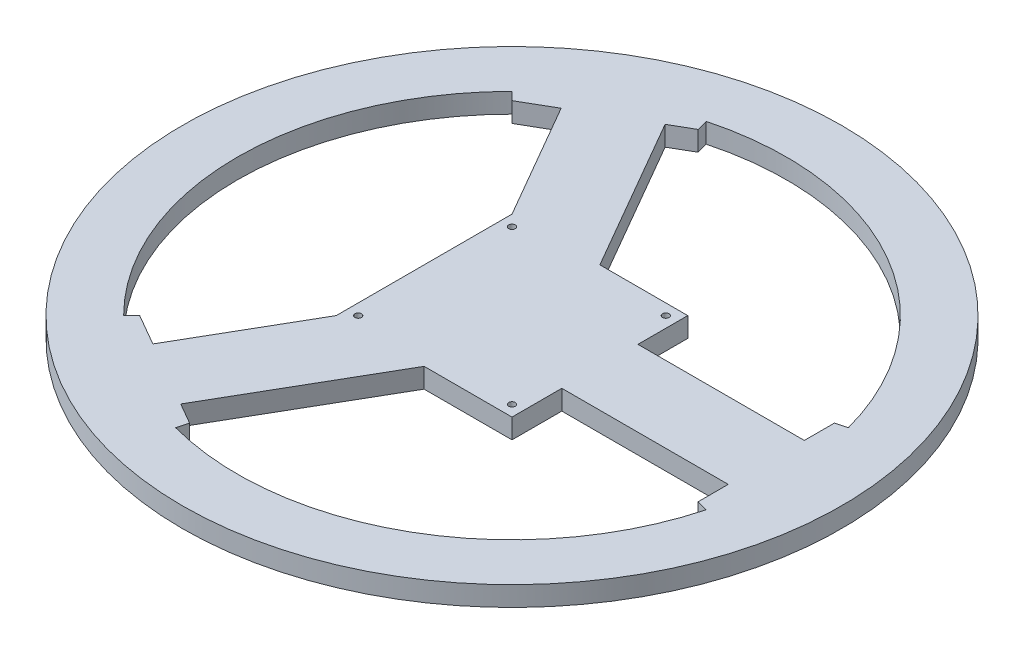
ISO-10303-21;
HEADER;
FILE_DESCRIPTION(('STEP AP214'),'2;1');
FILE_NAME('part.step','',(''),(''),'','','');
FILE_SCHEMA(('AUTOMOTIVE_DESIGN { 1 0 10303 214 1 1 1 1 }'));
ENDSEC;
DATA;
#1=APPLICATION_CONTEXT('core data for automotive mechanical design processes');
#2=APPLICATION_PROTOCOL_DEFINITION('international standard','automotive_design',2000,#1);
#3=PRODUCT_CONTEXT('',#1,'mechanical');
#4=PRODUCT('Part','Part','',(#3));
#5=PRODUCT_RELATED_PRODUCT_CATEGORY('part','',(#4));
#6=PRODUCT_DEFINITION_FORMATION('','',#4);
#7=PRODUCT_DEFINITION_CONTEXT('part definition',#1,'design');
#8=PRODUCT_DEFINITION('design','',#6,#7);
#9=PRODUCT_DEFINITION_SHAPE('','',#8);
#10=(LENGTH_UNIT() NAMED_UNIT(*) SI_UNIT(.MILLI.,.METRE.));
#11=(NAMED_UNIT(*) PLANE_ANGLE_UNIT() SI_UNIT($,.RADIAN.));
#12=(NAMED_UNIT(*) SI_UNIT($,.STERADIAN.) SOLID_ANGLE_UNIT());
#13=UNCERTAINTY_MEASURE_WITH_UNIT(LENGTH_MEASURE(1.E-05),#10,'distance_accuracy_value','');
#14=(GEOMETRIC_REPRESENTATION_CONTEXT(3) GLOBAL_UNCERTAINTY_ASSIGNED_CONTEXT((#13)) GLOBAL_UNIT_ASSIGNED_CONTEXT((#10,
#11,#12)) REPRESENTATION_CONTEXT('',''));
#15=CARTESIAN_POINT('',(0.,0.,0.));
#16=DIRECTION('',(0.,0.,1.));
#17=DIRECTION('',(1.,0.,0.));
#18=AXIS2_PLACEMENT_3D('',#15,#16,#17);
#19=CARTESIAN_POINT('',(115.740728286134,9.,-31.0126346756591));
#20=DIRECTION('',(1.,0.,0.));
#21=DIRECTION('',(0.,0.,-1.));
#22=AXIS2_PLACEMENT_3D('',#19,#20,#21);
#23=PLANE('',#22);
#24=DIRECTION('',(0.,-1.,0.));
#25=VECTOR('',#24,1.);
#26=CARTESIAN_POINT('',(115.740728286134,9.,17.32));
#27=LINE('',#26,#25);
#28=CARTESIAN_POINT('',(115.740728286134,9.,17.32));
#29=VERTEX_POINT('',#28);
#30=CARTESIAN_POINT('',(115.740728286134,0.,17.32));
#31=VERTEX_POINT('',#30);
#32=EDGE_CURVE('E239',#29,#31,#27,.T.);
#33=ORIENTED_EDGE('',*,*,#32,.T.);
#34=DIRECTION('',(0.,0.,1.));
#35=VECTOR('',#34,1.);
#36=CARTESIAN_POINT('',(115.740728286134,0.,-31.0126346756591));
#37=LINE('',#36,#35);
#38=CARTESIAN_POINT('',(115.740728286134,0.,31.0126346756592));
#39=VERTEX_POINT('',#38);
#40=EDGE_CURVE('E309',#31,#39,#37,.T.);
#41=ORIENTED_EDGE('',*,*,#40,.T.);
#42=DIRECTION('',(0.,-1.,0.));
#43=VECTOR('',#42,1.);
#44=CARTESIAN_POINT('',(115.740728286134,9.,31.0126346756592));
#45=LINE('',#44,#43);
#46=CARTESIAN_POINT('',(115.740728286134,9.,31.0126346756592));
#47=VERTEX_POINT('',#46);
#48=EDGE_CURVE('E304',#47,#39,#45,.T.);
#49=ORIENTED_EDGE('',*,*,#48,.F.);
#50=DIRECTION('',(0.,0.,1.));
#51=VECTOR('',#50,1.);
#52=CARTESIAN_POINT('',(115.740728286134,9.,-31.0126346756591));
#53=LINE('',#52,#51);
#54=EDGE_CURVE('E49',#29,#47,#53,.T.);
#55=ORIENTED_EDGE('',*,*,#54,.F.);
#56=EDGE_LOOP('',(#33,#41,#49,#55));
#57=FACE_BOUND('',#56,.T.);
#58=ADVANCED_FACE('F34',(#57),#23,.F.);
#59=DIRECTION('',(0.,-1.,0.));
#60=VECTOR('',#59,1.);
#61=CARTESIAN_POINT('',(115.740728286134,9.,-17.32));
#62=LINE('',#61,#60);
#63=CARTESIAN_POINT('',(115.740728286134,9.,-17.32));
#64=VERTEX_POINT('',#63);
#65=CARTESIAN_POINT('',(115.740728286134,0.,-17.32));
#66=VERTEX_POINT('',#65);
#67=EDGE_CURVE('E57',#64,#66,#62,.T.);
#68=ORIENTED_EDGE('',*,*,#67,.F.);
#69=CARTESIAN_POINT('',(115.740728286134,9.,-31.0126346756591));
#70=VERTEX_POINT('',#69);
#71=EDGE_CURVE('E302',#70,#64,#53,.T.);
#72=ORIENTED_EDGE('',*,*,#71,.F.);
#73=DIRECTION('',(0.,-1.,0.));
#74=VECTOR('',#73,1.);
#75=CARTESIAN_POINT('',(115.740728286134,9.,-31.0126346756591));
#76=LINE('',#75,#74);
#77=CARTESIAN_POINT('',(115.740728286134,0.,-31.0126346756591));
#78=VERTEX_POINT('',#77);
#79=EDGE_CURVE('E313',#70,#78,#76,.T.);
#80=ORIENTED_EDGE('',*,*,#79,.T.);
#81=EDGE_CURVE('E300',#78,#66,#37,.T.);
#82=ORIENTED_EDGE('',*,*,#81,.T.);
#83=EDGE_LOOP('',(#68,#72,#80,#82));
#84=FACE_BOUND('',#83,.T.);
#85=ADVANCED_FACE('F456',(#84),#23,.F.);
#86=CARTESIAN_POINT('',(-31.0126346756598,9.,115.740728286134));
#87=DIRECTION('',(-0.5,0.,0.866025403784439));
#88=DIRECTION('',(0.866025403784439,0.,0.5));
#89=AXIS2_PLACEMENT_3D('',#86,#87,#88);
#90=PLANE('',#89);
#91=DIRECTION('',(0.,-1.,0.));
#92=VECTOR('',#91,1.);
#93=CARTESIAN_POINT('',(-70.5498560673779,9.,92.9139028726152));
#94=LINE('',#93,#92);
#95=CARTESIAN_POINT('',(-70.5498560673779,9.,92.9139028726153));
#96=VERTEX_POINT('',#95);
#97=CARTESIAN_POINT('',(-70.5498560673779,0.,92.9139028726153));
#98=VERTEX_POINT('',#97);
#99=EDGE_CURVE('E383',#96,#98,#94,.T.);
#100=ORIENTED_EDGE('',*,*,#99,.T.);
#101=DIRECTION('',(-0.866025403784439,0.,-0.5));
#102=VECTOR('',#101,1.);
#103=CARTESIAN_POINT('',(-31.0126346756598,0.,115.740728286134));
#104=LINE('',#103,#102);
#105=CARTESIAN_POINT('',(-84.7280936104738,0.,84.7280936104744));
#106=VERTEX_POINT('',#105);
#107=EDGE_CURVE('E282',#98,#106,#104,.T.);
#108=ORIENTED_EDGE('',*,*,#107,.T.);
#109=DIRECTION('',(0.,-1.,0.));
#110=VECTOR('',#109,1.);
#111=CARTESIAN_POINT('',(-84.7280936104738,9.,84.7280936104744));
#112=LINE('',#111,#110);
#113=CARTESIAN_POINT('',(-84.7280936104738,9.,84.7280936104744));
#114=VERTEX_POINT('',#113);
#115=EDGE_CURVE('E277',#114,#106,#112,.T.);
#116=ORIENTED_EDGE('',*,*,#115,.F.);
#117=DIRECTION('',(-0.866025403784439,0.,-0.5));
#118=VECTOR('',#117,1.);
#119=CARTESIAN_POINT('',(-31.0126346756598,9.,115.740728286134));
#120=LINE('',#119,#118);
#121=EDGE_CURVE('E274',#96,#114,#120,.T.);
#122=ORIENTED_EDGE('',*,*,#121,.F.);
#123=EDGE_LOOP('',(#100,#108,#116,#122));
#124=FACE_BOUND('',#123,.T.);
#125=ADVANCED_FACE('F482',(#124),#90,.F.);
#126=DIRECTION('',(0.,-1.,0.));
#127=VECTOR('',#126,1.);
#128=CARTESIAN_POINT('',(-40.5498560673779,9.,110.234410948304));
#129=LINE('',#128,#127);
#130=CARTESIAN_POINT('',(-40.5498560673779,9.,110.234410948304));
#131=VERTEX_POINT('',#130);
#132=CARTESIAN_POINT('',(-40.5498560673779,0.,110.234410948304));
#133=VERTEX_POINT('',#132);
#134=EDGE_CURVE('E380',#131,#133,#129,.T.);
#135=ORIENTED_EDGE('',*,*,#134,.F.);
#136=CARTESIAN_POINT('',(-31.0126346756598,9.,115.740728286134));
#137=VERTEX_POINT('',#136);
#138=EDGE_CURVE('E275',#137,#131,#120,.T.);
#139=ORIENTED_EDGE('',*,*,#138,.F.);
#140=DIRECTION('',(0.,-1.,0.));
#141=VECTOR('',#140,1.);
#142=CARTESIAN_POINT('',(-31.0126346756598,9.,115.740728286134));
#143=LINE('',#142,#141);
#144=CARTESIAN_POINT('',(-31.0126346756598,0.,115.740728286134));
#145=VERTEX_POINT('',#144);
#146=EDGE_CURVE('E286',#137,#145,#143,.T.);
#147=ORIENTED_EDGE('',*,*,#146,.T.);
#148=EDGE_CURVE('E272',#145,#133,#104,.T.);
#149=ORIENTED_EDGE('',*,*,#148,.T.);
#150=EDGE_LOOP('',(#135,#139,#147,#149));
#151=FACE_BOUND('',#150,.T.);
#152=ADVANCED_FACE('F475',(#151),#90,.F.);
#153=CARTESIAN_POINT('',(-84.7280936104739,9.,-84.7280936104743));
#154=DIRECTION('',(-0.500000000000001,0.,-0.866025403784438));
#155=DIRECTION('',(-0.866025403784438,0.,0.500000000000001));
#156=AXIS2_PLACEMENT_3D('',#153,#154,#155);
#157=PLANE('',#156);
#158=DIRECTION('',(0.,-1.,0.));
#159=VECTOR('',#158,1.);
#160=CARTESIAN_POINT('',(-40.5498560673779,9.,-110.234410948304));
#161=LINE('',#160,#159);
#162=CARTESIAN_POINT('',(-40.5498560673779,9.,-110.234410948304));
#163=VERTEX_POINT('',#162);
#164=CARTESIAN_POINT('',(-40.5498560673779,0.,-110.234410948304));
#165=VERTEX_POINT('',#164);
#166=EDGE_CURVE('E394',#163,#165,#161,.T.);
#167=ORIENTED_EDGE('',*,*,#166,.T.);
#168=DIRECTION('',(0.866025403784438,0.,-0.500000000000001));
#169=VECTOR('',#168,1.);
#170=CARTESIAN_POINT('',(-84.7280936104739,0.,-84.7280936104743));
#171=LINE('',#170,#169);
#172=CARTESIAN_POINT('',(-31.0126346756599,0.,-115.740728286133));
#173=VERTEX_POINT('',#172);
#174=EDGE_CURVE('E254',#165,#173,#171,.T.);
#175=ORIENTED_EDGE('',*,*,#174,.T.);
#176=DIRECTION('',(0.,-1.,0.));
#177=VECTOR('',#176,1.);
#178=CARTESIAN_POINT('',(-31.0126346756599,9.,-115.740728286133));
#179=LINE('',#178,#177);
#180=CARTESIAN_POINT('',(-31.0126346756599,9.,-115.740728286133));
#181=VERTEX_POINT('',#180);
#182=EDGE_CURVE('E251',#181,#173,#179,.T.);
#183=ORIENTED_EDGE('',*,*,#182,.F.);
#184=DIRECTION('',(0.866025403784438,0.,-0.500000000000001));
#185=VECTOR('',#184,1.);
#186=CARTESIAN_POINT('',(-84.7280936104739,9.,-84.7280936104743));
#187=LINE('',#186,#185);
#188=EDGE_CURVE('E248',#163,#181,#187,.T.);
#189=ORIENTED_EDGE('',*,*,#188,.F.);
#190=EDGE_LOOP('',(#167,#175,#183,#189));
#191=FACE_BOUND('',#190,.T.);
#192=ADVANCED_FACE('F472',(#191),#157,.F.);
#193=DIRECTION('',(0.,-1.,0.));
#194=VECTOR('',#193,1.);
#195=CARTESIAN_POINT('',(-70.5498560673779,9.,-92.9139028726152));
#196=LINE('',#195,#194);
#197=CARTESIAN_POINT('',(-70.5498560673779,9.,-92.9139028726152));
#198=VERTEX_POINT('',#197);
#199=CARTESIAN_POINT('',(-70.5498560673779,0.,-92.9139028726152));
#200=VERTEX_POINT('',#199);
#201=EDGE_CURVE('E391',#198,#200,#196,.T.);
#202=ORIENTED_EDGE('',*,*,#201,.F.);
#203=CARTESIAN_POINT('',(-84.7280936104739,9.,-84.7280936104743));
#204=VERTEX_POINT('',#203);
#205=EDGE_CURVE('E249',#204,#198,#187,.T.);
#206=ORIENTED_EDGE('',*,*,#205,.F.);
#207=DIRECTION('',(0.,-1.,0.));
#208=VECTOR('',#207,1.);
#209=CARTESIAN_POINT('',(-84.7280936104739,9.,-84.7280936104743));
#210=LINE('',#209,#208);
#211=CARTESIAN_POINT('',(-84.7280936104739,0.,-84.7280936104743));
#212=VERTEX_POINT('',#211);
#213=EDGE_CURVE('E258',#204,#212,#210,.T.);
#214=ORIENTED_EDGE('',*,*,#213,.T.);
#215=EDGE_CURVE('E246',#212,#200,#171,.T.);
#216=ORIENTED_EDGE('',*,*,#215,.T.);
#217=EDGE_LOOP('',(#202,#206,#214,#216));
#218=FACE_BOUND('',#217,.T.);
#219=ADVANCED_FACE('F474',(#218),#157,.F.);
#220=CARTESIAN_POINT('',(0.,9.,0.));
#221=DIRECTION('',(0.,-1.,0.));
#222=DIRECTION('',(0.,0.,-1.));
#223=AXIS2_PLACEMENT_3D('',#220,#221,#222);
#224=CYLINDRICAL_SURFACE('',#223,125.);
#225=CARTESIAN_POINT('',(0.,9.,0.));
#226=DIRECTION('',(0.,1.,0.));
#227=DIRECTION('',(0.,0.,1.));
#228=AXIS2_PLACEMENT_3D('',#225,#226,#227);
#229=CIRCLE('',#228,125.);
#230=CARTESIAN_POINT('',(120.740728286134,9.,-32.3523806378147));
#231=VERTEX_POINT('',#230);
#232=CARTESIAN_POINT('',(-32.3523806378155,9.,-120.740728286133));
#233=VERTEX_POINT('',#232);
#234=EDGE_CURVE('E323',#231,#233,#229,.T.);
#235=ORIENTED_EDGE('',*,*,#234,.T.);
#236=DIRECTION('',(0.,-1.,0.));
#237=VECTOR('',#236,1.);
#238=CARTESIAN_POINT('',(-32.3523806378155,9.,-120.740728286133));
#239=LINE('',#238,#237);
#240=CARTESIAN_POINT('',(-32.3523806378155,0.,-120.740728286133));
#241=VERTEX_POINT('',#240);
#242=EDGE_CURVE('E264',#233,#241,#239,.T.);
#243=ORIENTED_EDGE('',*,*,#242,.T.);
#244=CARTESIAN_POINT('',(0.,0.,0.));
#245=DIRECTION('',(0.,1.,0.));
#246=DIRECTION('',(0.,0.,1.));
#247=AXIS2_PLACEMENT_3D('',#244,#245,#246);
#248=CIRCLE('',#247,125.);
#249=CARTESIAN_POINT('',(120.740728286134,0.,-32.3523806378148));
#250=VERTEX_POINT('',#249);
#251=EDGE_CURVE('E328',#250,#241,#248,.T.);
#252=ORIENTED_EDGE('',*,*,#251,.F.);
#253=DIRECTION('',(0.,-1.,0.));
#254=VECTOR('',#253,1.);
#255=CARTESIAN_POINT('',(120.740728286134,9.,-32.3523806378147));
#256=LINE('',#255,#254);
#257=EDGE_CURVE('E316',#231,#250,#256,.T.);
#258=ORIENTED_EDGE('',*,*,#257,.F.);
#259=EDGE_LOOP('',(#235,#243,#252,#258));
#260=FACE_BOUND('',#259,.T.);
#261=ADVANCED_FACE('F461',(#260),#224,.F.);
#262=CARTESIAN_POINT('',(-88.3883476483182,0.,-88.3883476483187));
#263=VERTEX_POINT('',#262);
#264=CARTESIAN_POINT('',(-88.3883476483182,0.,88.3883476483188));
#265=VERTEX_POINT('',#264);
#266=EDGE_CURVE('E330',#263,#265,#248,.T.);
#267=ORIENTED_EDGE('',*,*,#266,.F.);
#268=DIRECTION('',(0.,-1.,0.));
#269=VECTOR('',#268,1.);
#270=CARTESIAN_POINT('',(-88.3883476483183,9.,-88.3883476483187));
#271=LINE('',#270,#269);
#272=CARTESIAN_POINT('',(-88.3883476483183,9.,-88.3883476483187));
#273=VERTEX_POINT('',#272);
#274=EDGE_CURVE('E261',#273,#263,#271,.T.);
#275=ORIENTED_EDGE('',*,*,#274,.F.);
#276=CARTESIAN_POINT('',(-88.3883476483182,9.,88.3883476483188));
#277=VERTEX_POINT('',#276);
#278=EDGE_CURVE('E326',#273,#277,#229,.T.);
#279=ORIENTED_EDGE('',*,*,#278,.T.);
#280=DIRECTION('',(0.,-1.,0.));
#281=VECTOR('',#280,1.);
#282=CARTESIAN_POINT('',(-88.3883476483182,9.,88.3883476483188));
#283=LINE('',#282,#281);
#284=EDGE_CURVE('E292',#277,#265,#283,.T.);
#285=ORIENTED_EDGE('',*,*,#284,.T.);
#286=EDGE_LOOP('',(#267,#275,#279,#285));
#287=FACE_BOUND('',#286,.T.);
#288=ADVANCED_FACE('F502',(#287),#224,.F.);
#289=CARTESIAN_POINT('',(-32.3523806378154,0.,120.740728286133));
#290=VERTEX_POINT('',#289);
#291=CARTESIAN_POINT('',(120.740728286134,0.,32.3523806378148));
#292=VERTEX_POINT('',#291);
#293=EDGE_CURVE('E322',#290,#292,#248,.T.);
#294=ORIENTED_EDGE('',*,*,#293,.F.);
#295=DIRECTION('',(0.,-1.,0.));
#296=VECTOR('',#295,1.);
#297=CARTESIAN_POINT('',(-32.3523806378154,9.,120.740728286134));
#298=LINE('',#297,#296);
#299=CARTESIAN_POINT('',(-32.3523806378154,9.,120.740728286134));
#300=VERTEX_POINT('',#299);
#301=EDGE_CURVE('E289',#300,#290,#298,.T.);
#302=ORIENTED_EDGE('',*,*,#301,.F.);
#303=CARTESIAN_POINT('',(120.740728286134,9.,32.3523806378148));
#304=VERTEX_POINT('',#303);
#305=EDGE_CURVE('E327',#300,#304,#229,.T.);
#306=ORIENTED_EDGE('',*,*,#305,.T.);
#307=DIRECTION('',(0.,-1.,0.));
#308=VECTOR('',#307,1.);
#309=CARTESIAN_POINT('',(120.740728286134,9.,32.3523806378148));
#310=LINE('',#309,#308);
#311=EDGE_CURVE('E319',#304,#292,#310,.T.);
#312=ORIENTED_EDGE('',*,*,#311,.T.);
#313=EDGE_LOOP('',(#294,#302,#306,#312));
#314=FACE_BOUND('',#313,.T.);
#315=ADVANCED_FACE('F348',(#314),#224,.F.);
#316=CARTESIAN_POINT('',(0.,9.,0.));
#317=DIRECTION('',(0.,1.,0.));
#318=DIRECTION('',(0.,0.,1.));
#319=AXIS2_PLACEMENT_3D('',#316,#317,#318);
#320=PLANE('',#319);
#321=ORIENTED_EDGE('',*,*,#71,.T.);
#322=DIRECTION('',(-1.,0.,0.));
#323=VECTOR('',#322,1.);
#324=CARTESIAN_POINT('',(40.,9.,-17.32));
#325=LINE('',#324,#323);
#326=CARTESIAN_POINT('',(40.,9.,-17.32));
#327=VERTEX_POINT('',#326);
#328=EDGE_CURVE('E410',#64,#327,#325,.T.);
#329=ORIENTED_EDGE('',*,*,#328,.T.);
#330=DIRECTION('',(0.,0.,-1.));
#331=VECTOR('',#330,1.);
#332=CARTESIAN_POINT('',(40.,9.,-40.));
#333=LINE('',#332,#331);
#334=CARTESIAN_POINT('',(40.,9.,-40.));
#335=VERTEX_POINT('',#334);
#336=EDGE_CURVE('E428',#327,#335,#333,.T.);
#337=ORIENTED_EDGE('',*,*,#336,.T.);
#338=DIRECTION('',(-1.,0.,0.));
#339=VECTOR('',#338,1.);
#340=CARTESIAN_POINT('',(0.,9.,-40.));
#341=LINE('',#340,#339);
#342=CARTESIAN_POINT('',(0.,9.,-40.));
#343=VERTEX_POINT('',#342);
#344=EDGE_CURVE('E423',#335,#343,#341,.T.);
#345=ORIENTED_EDGE('',*,*,#344,.T.);
#346=DIRECTION('',(-0.499999999999998,0.,-0.86602540378444));
#347=VECTOR('',#346,1.);
#348=CARTESIAN_POINT('',(-40.5498560673779,9.,-110.234410948304));
#349=LINE('',#348,#347);
#350=EDGE_CURVE('E427',#343,#163,#349,.T.);
#351=ORIENTED_EDGE('',*,*,#350,.T.);
#352=ORIENTED_EDGE('',*,*,#188,.T.);
#353=DIRECTION('',(-0.258819045102523,0.,-0.965925826289068));
#354=VECTOR('',#353,1.);
#355=CARTESIAN_POINT('',(-31.0126346756599,9.,-115.740728286133));
#356=LINE('',#355,#354);
#357=EDGE_CURVE('E243',#181,#233,#356,.T.);
#358=ORIENTED_EDGE('',*,*,#357,.T.);
#359=ORIENTED_EDGE('',*,*,#234,.F.);
#360=DIRECTION('',(-0.965925826289069,0.,0.258819045102518));
#361=VECTOR('',#360,1.);
#362=CARTESIAN_POINT('',(120.740728286134,9.,-32.3523806378147));
#363=LINE('',#362,#361);
#364=EDGE_CURVE('E299',#231,#70,#363,.T.);
#365=ORIENTED_EDGE('',*,*,#364,.T.);
#366=EDGE_LOOP('',(#321,#329,#337,#345,#351,#352,#358,#359,#365));
#367=FACE_BOUND('',#366,.T.);
#368=ORIENTED_EDGE('',*,*,#138,.T.);
#369=DIRECTION('',(0.499999999999998,0.,-0.86602540378444));
#370=VECTOR('',#369,1.);
#371=CARTESIAN_POINT('',(0.,9.,40.));
#372=LINE('',#371,#370);
#373=CARTESIAN_POINT('',(0.,9.,40.));
#374=VERTEX_POINT('',#373);
#375=EDGE_CURVE('E226',#131,#374,#372,.T.);
#376=ORIENTED_EDGE('',*,*,#375,.T.);
#377=DIRECTION('',(1.,0.,0.));
#378=VECTOR('',#377,1.);
#379=CARTESIAN_POINT('',(40.,9.,40.));
#380=LINE('',#379,#378);
#381=CARTESIAN_POINT('',(40.,9.,40.));
#382=VERTEX_POINT('',#381);
#383=EDGE_CURVE('E219',#374,#382,#380,.T.);
#384=ORIENTED_EDGE('',*,*,#383,.T.);
#385=DIRECTION('',(0.,0.,-1.));
#386=VECTOR('',#385,1.);
#387=CARTESIAN_POINT('',(40.,9.,17.32));
#388=LINE('',#387,#386);
#389=CARTESIAN_POINT('',(40.,9.,17.32));
#390=VERTEX_POINT('',#389);
#391=EDGE_CURVE('E208',#382,#390,#388,.T.);
#392=ORIENTED_EDGE('',*,*,#391,.T.);
#393=DIRECTION('',(1.,0.,0.));
#394=VECTOR('',#393,1.);
#395=CARTESIAN_POINT('',(115.740728286134,9.,17.32));
#396=LINE('',#395,#394);
#397=EDGE_CURVE('E218',#390,#29,#396,.T.);
#398=ORIENTED_EDGE('',*,*,#397,.T.);
#399=ORIENTED_EDGE('',*,*,#54,.T.);
#400=DIRECTION('',(0.965925826289069,0.,0.258819045102518));
#401=VECTOR('',#400,1.);
#402=CARTESIAN_POINT('',(115.740728286134,9.,31.0126346756592));
#403=LINE('',#402,#401);
#404=EDGE_CURVE('E296',#47,#304,#403,.T.);
#405=ORIENTED_EDGE('',*,*,#404,.T.);
#406=ORIENTED_EDGE('',*,*,#305,.F.);
#407=DIRECTION('',(0.258819045102525,0.,-0.965925826289067));
#408=VECTOR('',#407,1.);
#409=CARTESIAN_POINT('',(-32.3523806378154,9.,120.740728286134));
#410=LINE('',#409,#408);
#411=EDGE_CURVE('E271',#300,#137,#410,.T.);
#412=ORIENTED_EDGE('',*,*,#411,.T.);
#413=EDGE_LOOP('',(#368,#376,#384,#392,#398,#399,#405,#406,#412));
#414=FACE_BOUND('',#413,.T.);
#415=ORIENTED_EDGE('',*,*,#278,.F.);
#416=DIRECTION('',(0.707106781186546,0.,0.707106781186549));
#417=VECTOR('',#416,1.);
#418=CARTESIAN_POINT('',(-88.3883476483183,9.,-88.3883476483187));
#419=LINE('',#418,#417);
#420=EDGE_CURVE('E245',#273,#204,#419,.T.);
#421=ORIENTED_EDGE('',*,*,#420,.T.);
#422=ORIENTED_EDGE('',*,*,#205,.T.);
#423=DIRECTION('',(0.499999999999998,0.,0.86602540378444));
#424=VECTOR('',#423,1.);
#425=CARTESIAN_POINT('',(-70.5498560673779,9.,-92.9139028726152));
#426=LINE('',#425,#424);
#427=CARTESIAN_POINT('',(-40.,9.,-40.));
#428=VERTEX_POINT('',#427);
#429=EDGE_CURVE('E430',#198,#428,#426,.T.);
#430=ORIENTED_EDGE('',*,*,#429,.T.);
#431=DIRECTION('',(0.,0.,1.));
#432=VECTOR('',#431,1.);
#433=CARTESIAN_POINT('',(-40.,9.,40.));
#434=LINE('',#433,#432);
#435=CARTESIAN_POINT('',(-40.,9.,40.));
#436=VERTEX_POINT('',#435);
#437=EDGE_CURVE('E436',#428,#436,#434,.T.);
#438=ORIENTED_EDGE('',*,*,#437,.T.);
#439=DIRECTION('',(-0.499999999999998,0.,0.86602540378444));
#440=VECTOR('',#439,1.);
#441=CARTESIAN_POINT('',(-70.5498560673779,9.,92.9139028726152));
#442=LINE('',#441,#440);
#443=EDGE_CURVE('E438',#436,#96,#442,.T.);
#444=ORIENTED_EDGE('',*,*,#443,.T.);
#445=ORIENTED_EDGE('',*,*,#121,.T.);
#446=DIRECTION('',(-0.707106781186546,0.,0.707106781186549));
#447=VECTOR('',#446,1.);
#448=CARTESIAN_POINT('',(-84.7280936104738,9.,84.7280936104744));
#449=LINE('',#448,#447);
#450=EDGE_CURVE('E268',#114,#277,#449,.T.);
#451=ORIENTED_EDGE('',*,*,#450,.T.);
#452=EDGE_LOOP('',(#415,#421,#422,#430,#438,#444,#445,#451));
#453=FACE_BOUND('',#452,.T.);
#454=CARTESIAN_POINT('',(0.,9.,0.));
#455=DIRECTION('',(0.,1.,0.));
#456=DIRECTION('',(0.,0.,1.));
#457=AXIS2_PLACEMENT_3D('',#454,#455,#456);
#458=CIRCLE('',#457,150.);
#459=CARTESIAN_POINT('',(0.,9.,150.));
#460=VERTEX_POINT('',#459);
#461=EDGE_CURVE('E11',#460,#460,#458,.T.);
#462=ORIENTED_EDGE('',*,*,#461,.T.);
#463=EDGE_LOOP('',(#462));
#464=FACE_BOUND('',#463,.T.);
#465=CARTESIAN_POINT('',(-35.,9.,-35.));
#466=DIRECTION('',(0.,1.,0.));
#467=DIRECTION('',(0.,0.,1.));
#468=AXIS2_PLACEMENT_3D('',#465,#466,#467);
#469=CIRCLE('',#468,1.5);
#470=CARTESIAN_POINT('',(-35.,9.,-33.5));
#471=VERTEX_POINT('',#470);
#472=EDGE_CURVE('E441',#471,#471,#469,.T.);
#473=ORIENTED_EDGE('',*,*,#472,.F.);
#474=EDGE_LOOP('',(#473));
#475=FACE_BOUND('',#474,.T.);
#476=CARTESIAN_POINT('',(35.,9.,-35.));
#477=DIRECTION('',(0.,1.,0.));
#478=DIRECTION('',(0.,0.,1.));
#479=AXIS2_PLACEMENT_3D('',#476,#477,#478);
#480=CIRCLE('',#479,1.5);
#481=CARTESIAN_POINT('',(35.,9.,-33.5));
#482=VERTEX_POINT('',#481);
#483=EDGE_CURVE('E448',#482,#482,#480,.T.);
#484=ORIENTED_EDGE('',*,*,#483,.F.);
#485=EDGE_LOOP('',(#484));
#486=FACE_BOUND('',#485,.T.);
#487=CARTESIAN_POINT('',(35.,9.,35.));
#488=DIRECTION('',(0.,1.,0.));
#489=DIRECTION('',(0.,0.,1.));
#490=AXIS2_PLACEMENT_3D('',#487,#488,#489);
#491=CIRCLE('',#490,1.5);
#492=CARTESIAN_POINT('',(35.,9.,36.5));
#493=VERTEX_POINT('',#492);
#494=EDGE_CURVE('E535',#493,#493,#491,.T.);
#495=ORIENTED_EDGE('',*,*,#494,.F.);
#496=EDGE_LOOP('',(#495));
#497=FACE_BOUND('',#496,.T.);
#498=CARTESIAN_POINT('',(-35.,9.,35.));
#499=DIRECTION('',(0.,1.,0.));
#500=DIRECTION('',(0.,0.,1.));
#501=AXIS2_PLACEMENT_3D('',#498,#499,#500);
#502=CIRCLE('',#501,1.5);
#503=CARTESIAN_POINT('',(-35.,9.,36.5));
#504=VERTEX_POINT('',#503);
#505=EDGE_CURVE('E530',#504,#504,#502,.T.);
#506=ORIENTED_EDGE('',*,*,#505,.F.);
#507=EDGE_LOOP('',(#506));
#508=FACE_BOUND('',#507,.T.);
#509=ADVANCED_FACE('F223',(#367,#414,#453,#464,#475,#486,#497,#508),#320,.T.);
#510=CARTESIAN_POINT('',(0.,0.,0.));
#511=DIRECTION('',(0.,1.,0.));
#512=DIRECTION('',(0.,0.,1.));
#513=AXIS2_PLACEMENT_3D('',#510,#511,#512);
#514=PLANE('',#513);
#515=DIRECTION('',(-1.,0.,0.));
#516=VECTOR('',#515,1.);
#517=CARTESIAN_POINT('',(40.,0.,-17.32));
#518=LINE('',#517,#516);
#519=CARTESIAN_POINT('',(40.,0.,-17.32));
#520=VERTEX_POINT('',#519);
#521=EDGE_CURVE('E356',#66,#520,#518,.T.);
#522=ORIENTED_EDGE('',*,*,#521,.F.);
#523=ORIENTED_EDGE('',*,*,#81,.F.);
#524=DIRECTION('',(-0.965925826289069,0.,0.258819045102518));
#525=VECTOR('',#524,1.);
#526=CARTESIAN_POINT('',(120.740728286134,0.,-32.3523806378147));
#527=LINE('',#526,#525);
#528=EDGE_CURVE('E307',#250,#78,#527,.T.);
#529=ORIENTED_EDGE('',*,*,#528,.F.);
#530=ORIENTED_EDGE('',*,*,#251,.T.);
#531=DIRECTION('',(-0.258819045102523,0.,-0.965925826289068));
#532=VECTOR('',#531,1.);
#533=CARTESIAN_POINT('',(-31.0126346756599,0.,-115.740728286133));
#534=LINE('',#533,#532);
#535=EDGE_CURVE('E235',#173,#241,#534,.T.);
#536=ORIENTED_EDGE('',*,*,#535,.F.);
#537=ORIENTED_EDGE('',*,*,#174,.F.);
#538=DIRECTION('',(-0.499999999999998,0.,-0.86602540378444));
#539=VECTOR('',#538,1.);
#540=CARTESIAN_POINT('',(-40.5498560673779,0.,-110.234410948304));
#541=LINE('',#540,#539);
#542=CARTESIAN_POINT('',(0.,0.,-40.));
#543=VERTEX_POINT('',#542);
#544=EDGE_CURVE('E367',#543,#165,#541,.T.);
#545=ORIENTED_EDGE('',*,*,#544,.F.);
#546=DIRECTION('',(-1.,0.,0.));
#547=VECTOR('',#546,1.);
#548=CARTESIAN_POINT('',(0.,0.,-40.));
#549=LINE('',#548,#547);
#550=CARTESIAN_POINT('',(40.,0.,-40.));
#551=VERTEX_POINT('',#550);
#552=EDGE_CURVE('E365',#551,#543,#549,.T.);
#553=ORIENTED_EDGE('',*,*,#552,.F.);
#554=DIRECTION('',(0.,0.,-1.));
#555=VECTOR('',#554,1.);
#556=CARTESIAN_POINT('',(40.,0.,-40.));
#557=LINE('',#556,#555);
#558=EDGE_CURVE('E359',#520,#551,#557,.T.);
#559=ORIENTED_EDGE('',*,*,#558,.F.);
#560=EDGE_LOOP('',(#522,#523,#529,#530,#536,#537,#545,#553,#559));
#561=FACE_BOUND('',#560,.T.);
#562=DIRECTION('',(0.499999999999998,0.,-0.86602540378444));
#563=VECTOR('',#562,1.);
#564=CARTESIAN_POINT('',(0.,0.,40.));
#565=LINE('',#564,#563);
#566=CARTESIAN_POINT('',(0.,0.,40.));
#567=VERTEX_POINT('',#566);
#568=EDGE_CURVE('E230',#133,#567,#565,.T.);
#569=ORIENTED_EDGE('',*,*,#568,.F.);
#570=ORIENTED_EDGE('',*,*,#148,.F.);
#571=DIRECTION('',(0.258819045102525,0.,-0.965925826289067));
#572=VECTOR('',#571,1.);
#573=CARTESIAN_POINT('',(-32.3523806378154,0.,120.740728286134));
#574=LINE('',#573,#572);
#575=EDGE_CURVE('E280',#290,#145,#574,.T.);
#576=ORIENTED_EDGE('',*,*,#575,.F.);
#577=ORIENTED_EDGE('',*,*,#293,.T.);
#578=DIRECTION('',(0.965925826289069,0.,0.258819045102518));
#579=VECTOR('',#578,1.);
#580=CARTESIAN_POINT('',(115.740728286134,0.,31.0126346756592));
#581=LINE('',#580,#579);
#582=EDGE_CURVE('E295',#39,#292,#581,.T.);
#583=ORIENTED_EDGE('',*,*,#582,.F.);
#584=ORIENTED_EDGE('',*,*,#40,.F.);
#585=DIRECTION('',(1.,0.,0.));
#586=VECTOR('',#585,1.);
#587=CARTESIAN_POINT('',(115.740728286134,0.,17.32));
#588=LINE('',#587,#586);
#589=CARTESIAN_POINT('',(40.,0.,17.32));
#590=VERTEX_POINT('',#589);
#591=EDGE_CURVE('E353',#590,#31,#588,.T.);
#592=ORIENTED_EDGE('',*,*,#591,.F.);
#593=DIRECTION('',(0.,0.,-1.));
#594=VECTOR('',#593,1.);
#595=CARTESIAN_POINT('',(40.,0.,17.32));
#596=LINE('',#595,#594);
#597=CARTESIAN_POINT('',(40.,0.,40.));
#598=VERTEX_POINT('',#597);
#599=EDGE_CURVE('E357',#598,#590,#596,.T.);
#600=ORIENTED_EDGE('',*,*,#599,.F.);
#601=DIRECTION('',(1.,0.,0.));
#602=VECTOR('',#601,1.);
#603=CARTESIAN_POINT('',(40.,0.,40.));
#604=LINE('',#603,#602);
#605=EDGE_CURVE('E234',#567,#598,#604,.T.);
#606=ORIENTED_EDGE('',*,*,#605,.F.);
#607=EDGE_LOOP('',(#569,#570,#576,#577,#583,#584,#592,#600,#606));
#608=FACE_BOUND('',#607,.T.);
#609=ORIENTED_EDGE('',*,*,#107,.F.);
#610=DIRECTION('',(-0.499999999999998,0.,0.86602540378444));
#611=VECTOR('',#610,1.);
#612=CARTESIAN_POINT('',(-70.5498560673779,0.,92.9139028726152));
#613=LINE('',#612,#611);
#614=CARTESIAN_POINT('',(-40.,0.,40.));
#615=VERTEX_POINT('',#614);
#616=EDGE_CURVE('E374',#615,#98,#613,.T.);
#617=ORIENTED_EDGE('',*,*,#616,.F.);
#618=DIRECTION('',(0.,0.,1.));
#619=VECTOR('',#618,1.);
#620=CARTESIAN_POINT('',(-40.,0.,40.));
#621=LINE('',#620,#619);
#622=CARTESIAN_POINT('',(-40.,0.,-40.));
#623=VERTEX_POINT('',#622);
#624=EDGE_CURVE('E372',#623,#615,#621,.T.);
#625=ORIENTED_EDGE('',*,*,#624,.F.);
#626=DIRECTION('',(0.499999999999998,0.,0.86602540378444));
#627=VECTOR('',#626,1.);
#628=CARTESIAN_POINT('',(-70.5498560673779,0.,-92.9139028726152));
#629=LINE('',#628,#627);
#630=EDGE_CURVE('E370',#200,#623,#629,.T.);
#631=ORIENTED_EDGE('',*,*,#630,.F.);
#632=ORIENTED_EDGE('',*,*,#215,.F.);
#633=DIRECTION('',(0.707106781186546,0.,0.707106781186549));
#634=VECTOR('',#633,1.);
#635=CARTESIAN_POINT('',(-88.3883476483183,0.,-88.3883476483187));
#636=LINE('',#635,#634);
#637=EDGE_CURVE('E237',#263,#212,#636,.T.);
#638=ORIENTED_EDGE('',*,*,#637,.F.);
#639=ORIENTED_EDGE('',*,*,#266,.T.);
#640=DIRECTION('',(-0.707106781186546,0.,0.707106781186549));
#641=VECTOR('',#640,1.);
#642=CARTESIAN_POINT('',(-84.7280936104738,0.,84.7280936104744));
#643=LINE('',#642,#641);
#644=EDGE_CURVE('E267',#106,#265,#643,.T.);
#645=ORIENTED_EDGE('',*,*,#644,.F.);
#646=EDGE_LOOP('',(#609,#617,#625,#631,#632,#638,#639,#645));
#647=FACE_BOUND('',#646,.T.);
#648=CARTESIAN_POINT('',(0.,0.,0.));
#649=DIRECTION('',(0.,1.,0.));
#650=DIRECTION('',(0.,0.,1.));
#651=AXIS2_PLACEMENT_3D('',#648,#649,#650);
#652=CIRCLE('',#651,150.);
#653=CARTESIAN_POINT('',(0.,0.,150.));
#654=VERTEX_POINT('',#653);
#655=EDGE_CURVE('E38',#654,#654,#652,.T.);
#656=ORIENTED_EDGE('',*,*,#655,.F.);
#657=EDGE_LOOP('',(#656));
#658=FACE_BOUND('',#657,.T.);
#659=CARTESIAN_POINT('',(35.,0.,35.));
#660=DIRECTION('',(0.,1.,0.));
#661=DIRECTION('',(0.,0.,1.));
#662=AXIS2_PLACEMENT_3D('',#659,#660,#661);
#663=CIRCLE('',#662,1.5);
#664=CARTESIAN_POINT('',(35.,0.,36.5));
#665=VERTEX_POINT('',#664);
#666=EDGE_CURVE('E520',#665,#665,#663,.T.);
#667=ORIENTED_EDGE('',*,*,#666,.T.);
#668=EDGE_LOOP('',(#667));
#669=FACE_BOUND('',#668,.T.);
#670=CARTESIAN_POINT('',(-35.,0.,-35.));
#671=DIRECTION('',(0.,1.,0.));
#672=DIRECTION('',(0.,0.,1.));
#673=AXIS2_PLACEMENT_3D('',#670,#671,#672);
#674=CIRCLE('',#673,1.5);
#675=CARTESIAN_POINT('',(-35.,0.,-33.5));
#676=VERTEX_POINT('',#675);
#677=EDGE_CURVE('E443',#676,#676,#674,.T.);
#678=ORIENTED_EDGE('',*,*,#677,.T.);
#679=EDGE_LOOP('',(#678));
#680=FACE_BOUND('',#679,.T.);
#681=CARTESIAN_POINT('',(35.,0.,-35.));
#682=DIRECTION('',(0.,1.,0.));
#683=DIRECTION('',(0.,0.,1.));
#684=AXIS2_PLACEMENT_3D('',#681,#682,#683);
#685=CIRCLE('',#684,1.5);
#686=CARTESIAN_POINT('',(35.,0.,-33.5));
#687=VERTEX_POINT('',#686);
#688=EDGE_CURVE('E451',#687,#687,#685,.T.);
#689=ORIENTED_EDGE('',*,*,#688,.T.);
#690=EDGE_LOOP('',(#689));
#691=FACE_BOUND('',#690,.T.);
#692=CARTESIAN_POINT('',(-35.,0.,35.));
#693=DIRECTION('',(0.,1.,0.));
#694=DIRECTION('',(0.,0.,1.));
#695=AXIS2_PLACEMENT_3D('',#692,#693,#694);
#696=CIRCLE('',#695,1.5);
#697=CARTESIAN_POINT('',(-35.,0.,36.5));
#698=VERTEX_POINT('',#697);
#699=EDGE_CURVE('E528',#698,#698,#696,.T.);
#700=ORIENTED_EDGE('',*,*,#699,.T.);
#701=EDGE_LOOP('',(#700));
#702=FACE_BOUND('',#701,.T.);
#703=ADVANCED_FACE('F338',(#561,#608,#647,#658,#669,#680,#691,#702),#514,.F.);
#704=CARTESIAN_POINT('',(0.,9.,0.));
#705=DIRECTION('',(0.,-1.,0.));
#706=DIRECTION('',(0.,0.,-1.));
#707=AXIS2_PLACEMENT_3D('',#704,#705,#706);
#708=CYLINDRICAL_SURFACE('',#707,150.);
#709=ORIENTED_EDGE('',*,*,#461,.F.);
#710=EDGE_LOOP('',(#709));
#711=FACE_BOUND('',#710,.T.);
#712=ORIENTED_EDGE('',*,*,#655,.T.);
#713=EDGE_LOOP('',(#712));
#714=FACE_BOUND('',#713,.T.);
#715=ADVANCED_FACE('F36',(#711,#714),#708,.T.);
#716=CARTESIAN_POINT('',(115.740728286134,9.,31.0126346756592));
#717=DIRECTION('',(0.258819045102518,0.,-0.965925826289069));
#718=DIRECTION('',(-0.965925826289069,0.,-0.258819045102518));
#719=AXIS2_PLACEMENT_3D('',#716,#717,#718);
#720=PLANE('',#719);
#721=ORIENTED_EDGE('',*,*,#582,.T.);
#722=ORIENTED_EDGE('',*,*,#311,.F.);
#723=ORIENTED_EDGE('',*,*,#404,.F.);
#724=ORIENTED_EDGE('',*,*,#48,.T.);
#725=EDGE_LOOP('',(#721,#722,#723,#724));
#726=FACE_BOUND('',#725,.T.);
#727=ADVANCED_FACE('F346',(#726),#720,.F.);
#728=CARTESIAN_POINT('',(120.740728286134,9.,-32.3523806378147));
#729=DIRECTION('',(0.258819045102518,0.,0.965925826289069));
#730=DIRECTION('',(0.965925826289069,0.,-0.258819045102518));
#731=AXIS2_PLACEMENT_3D('',#728,#729,#730);
#732=PLANE('',#731);
#733=ORIENTED_EDGE('',*,*,#528,.T.);
#734=ORIENTED_EDGE('',*,*,#79,.F.);
#735=ORIENTED_EDGE('',*,*,#364,.F.);
#736=ORIENTED_EDGE('',*,*,#257,.T.);
#737=EDGE_LOOP('',(#733,#734,#735,#736));
#738=FACE_BOUND('',#737,.T.);
#739=ADVANCED_FACE('F458',(#738),#732,.F.);
#740=CARTESIAN_POINT('',(-84.7280936104738,9.,84.7280936104744));
#741=DIRECTION('',(0.707106781186549,0.,0.707106781186546));
#742=DIRECTION('',(0.707106781186546,0.,-0.707106781186549));
#743=AXIS2_PLACEMENT_3D('',#740,#741,#742);
#744=PLANE('',#743);
#745=ORIENTED_EDGE('',*,*,#644,.T.);
#746=ORIENTED_EDGE('',*,*,#284,.F.);
#747=ORIENTED_EDGE('',*,*,#450,.F.);
#748=ORIENTED_EDGE('',*,*,#115,.T.);
#749=EDGE_LOOP('',(#745,#746,#747,#748));
#750=FACE_BOUND('',#749,.T.);
#751=ADVANCED_FACE('F494',(#750),#744,.F.);
#752=CARTESIAN_POINT('',(-32.3523806378154,9.,120.740728286134));
#753=DIRECTION('',(-0.965925826289067,0.,-0.258819045102525));
#754=DIRECTION('',(-0.258819045102525,0.,0.965925826289067));
#755=AXIS2_PLACEMENT_3D('',#752,#753,#754);
#756=PLANE('',#755);
#757=ORIENTED_EDGE('',*,*,#575,.T.);
#758=ORIENTED_EDGE('',*,*,#146,.F.);
#759=ORIENTED_EDGE('',*,*,#411,.F.);
#760=ORIENTED_EDGE('',*,*,#301,.T.);
#761=EDGE_LOOP('',(#757,#758,#759,#760));
#762=FACE_BOUND('',#761,.T.);
#763=ADVANCED_FACE('F600',(#762),#756,.F.);
#764=CARTESIAN_POINT('',(-31.0126346756599,9.,-115.740728286133));
#765=DIRECTION('',(-0.965925826289068,0.,0.258819045102523));
#766=DIRECTION('',(0.258819045102523,0.,0.965925826289068));
#767=AXIS2_PLACEMENT_3D('',#764,#765,#766);
#768=PLANE('',#767);
#769=ORIENTED_EDGE('',*,*,#535,.T.);
#770=ORIENTED_EDGE('',*,*,#242,.F.);
#771=ORIENTED_EDGE('',*,*,#357,.F.);
#772=ORIENTED_EDGE('',*,*,#182,.T.);
#773=EDGE_LOOP('',(#769,#770,#771,#772));
#774=FACE_BOUND('',#773,.T.);
#775=ADVANCED_FACE('F465',(#774),#768,.F.);
#776=CARTESIAN_POINT('',(-88.3883476483183,9.,-88.3883476483187));
#777=DIRECTION('',(0.707106781186549,0.,-0.707106781186546));
#778=DIRECTION('',(-0.707106781186546,0.,-0.707106781186549));
#779=AXIS2_PLACEMENT_3D('',#776,#777,#778);
#780=PLANE('',#779);
#781=ORIENTED_EDGE('',*,*,#637,.T.);
#782=ORIENTED_EDGE('',*,*,#213,.F.);
#783=ORIENTED_EDGE('',*,*,#420,.F.);
#784=ORIENTED_EDGE('',*,*,#274,.T.);
#785=EDGE_LOOP('',(#781,#782,#783,#784));
#786=FACE_BOUND('',#785,.T.);
#787=ADVANCED_FACE('F592',(#786),#780,.F.);
#788=CARTESIAN_POINT('',(40.,9.,40.));
#789=DIRECTION('',(0.,0.,-1.));
#790=DIRECTION('',(-1.,0.,0.));
#791=AXIS2_PLACEMENT_3D('',#788,#789,#790);
#792=PLANE('',#791);
#793=ORIENTED_EDGE('',*,*,#605,.T.);
#794=DIRECTION('',(0.,-1.,0.));
#795=VECTOR('',#794,1.);
#796=CARTESIAN_POINT('',(40.,9.,40.));
#797=LINE('',#796,#795);
#798=EDGE_CURVE('E212',#382,#598,#797,.T.);
#799=ORIENTED_EDGE('',*,*,#798,.F.);
#800=ORIENTED_EDGE('',*,*,#383,.F.);
#801=DIRECTION('',(0.,-1.,0.));
#802=VECTOR('',#801,1.);
#803=CARTESIAN_POINT('',(0.,9.,40.));
#804=LINE('',#803,#802);
#805=EDGE_CURVE('E378',#374,#567,#804,.T.);
#806=ORIENTED_EDGE('',*,*,#805,.T.);
#807=EDGE_LOOP('',(#793,#799,#800,#806));
#808=FACE_BOUND('',#807,.T.);
#809=ADVANCED_FACE('F232',(#808),#792,.F.);
#810=CARTESIAN_POINT('',(40.,9.,17.32));
#811=DIRECTION('',(-1.,0.,0.));
#812=DIRECTION('',(0.,0.,1.));
#813=AXIS2_PLACEMENT_3D('',#810,#811,#812);
#814=PLANE('',#813);
#815=ORIENTED_EDGE('',*,*,#599,.T.);
#816=DIRECTION('',(0.,-1.,0.));
#817=VECTOR('',#816,1.);
#818=CARTESIAN_POINT('',(40.,9.,17.32));
#819=LINE('',#818,#817);
#820=EDGE_CURVE('E215',#390,#590,#819,.T.);
#821=ORIENTED_EDGE('',*,*,#820,.F.);
#822=ORIENTED_EDGE('',*,*,#391,.F.);
#823=ORIENTED_EDGE('',*,*,#798,.T.);
#824=EDGE_LOOP('',(#815,#821,#822,#823));
#825=FACE_BOUND('',#824,.T.);
#826=ADVANCED_FACE('F210',(#825),#814,.F.);
#827=CARTESIAN_POINT('',(115.740728286134,9.,17.32));
#828=DIRECTION('',(0.,0.,-1.));
#829=DIRECTION('',(-1.,0.,0.));
#830=AXIS2_PLACEMENT_3D('',#827,#828,#829);
#831=PLANE('',#830);
#832=ORIENTED_EDGE('',*,*,#591,.T.);
#833=ORIENTED_EDGE('',*,*,#32,.F.);
#834=ORIENTED_EDGE('',*,*,#397,.F.);
#835=ORIENTED_EDGE('',*,*,#820,.T.);
#836=EDGE_LOOP('',(#832,#833,#834,#835));
#837=FACE_BOUND('',#836,.T.);
#838=ADVANCED_FACE('F355',(#837),#831,.F.);
#839=CARTESIAN_POINT('',(40.,9.,-17.32));
#840=DIRECTION('',(0.,0.,1.));
#841=DIRECTION('',(1.,0.,0.));
#842=AXIS2_PLACEMENT_3D('',#839,#840,#841);
#843=PLANE('',#842);
#844=ORIENTED_EDGE('',*,*,#521,.T.);
#845=DIRECTION('',(0.,-1.,0.));
#846=VECTOR('',#845,1.);
#847=CARTESIAN_POINT('',(40.,9.,-17.32));
#848=LINE('',#847,#846);
#849=EDGE_CURVE('E402',#327,#520,#848,.T.);
#850=ORIENTED_EDGE('',*,*,#849,.F.);
#851=ORIENTED_EDGE('',*,*,#328,.F.);
#852=ORIENTED_EDGE('',*,*,#67,.T.);
#853=EDGE_LOOP('',(#844,#850,#851,#852));
#854=FACE_BOUND('',#853,.T.);
#855=ADVANCED_FACE('F408',(#854),#843,.F.);
#856=CARTESIAN_POINT('',(40.,9.,-40.));
#857=DIRECTION('',(-1.,0.,0.));
#858=DIRECTION('',(0.,0.,1.));
#859=AXIS2_PLACEMENT_3D('',#856,#857,#858);
#860=PLANE('',#859);
#861=ORIENTED_EDGE('',*,*,#558,.T.);
#862=DIRECTION('',(0.,-1.,0.));
#863=VECTOR('',#862,1.);
#864=CARTESIAN_POINT('',(40.,9.,-40.));
#865=LINE('',#864,#863);
#866=EDGE_CURVE('E399',#335,#551,#865,.T.);
#867=ORIENTED_EDGE('',*,*,#866,.F.);
#868=ORIENTED_EDGE('',*,*,#336,.F.);
#869=ORIENTED_EDGE('',*,*,#849,.T.);
#870=EDGE_LOOP('',(#861,#867,#868,#869));
#871=FACE_BOUND('',#870,.T.);
#872=ADVANCED_FACE('F417',(#871),#860,.F.);
#873=CARTESIAN_POINT('',(0.,9.,-40.));
#874=DIRECTION('',(0.,0.,1.));
#875=DIRECTION('',(1.,0.,0.));
#876=AXIS2_PLACEMENT_3D('',#873,#874,#875);
#877=PLANE('',#876);
#878=ORIENTED_EDGE('',*,*,#552,.T.);
#879=DIRECTION('',(0.,-1.,0.));
#880=VECTOR('',#879,1.);
#881=CARTESIAN_POINT('',(0.,9.,-40.));
#882=LINE('',#881,#880);
#883=EDGE_CURVE('E396',#343,#543,#882,.T.);
#884=ORIENTED_EDGE('',*,*,#883,.F.);
#885=ORIENTED_EDGE('',*,*,#344,.F.);
#886=ORIENTED_EDGE('',*,*,#866,.T.);
#887=EDGE_LOOP('',(#878,#884,#885,#886));
#888=FACE_BOUND('',#887,.T.);
#889=ADVANCED_FACE('F421',(#888),#877,.F.);
#890=CARTESIAN_POINT('',(-40.5498560673779,9.,-110.234410948304));
#891=DIRECTION('',(-0.86602540378444,0.,0.499999999999998));
#892=DIRECTION('',(0.499999999999998,0.,0.86602540378444));
#893=AXIS2_PLACEMENT_3D('',#890,#891,#892);
#894=PLANE('',#893);
#895=ORIENTED_EDGE('',*,*,#544,.T.);
#896=ORIENTED_EDGE('',*,*,#166,.F.);
#897=ORIENTED_EDGE('',*,*,#350,.F.);
#898=ORIENTED_EDGE('',*,*,#883,.T.);
#899=EDGE_LOOP('',(#895,#896,#897,#898));
#900=FACE_BOUND('',#899,.T.);
#901=ADVANCED_FACE('F471',(#900),#894,.F.);
#902=CARTESIAN_POINT('',(-70.5498560673779,9.,-92.9139028726152));
#903=DIRECTION('',(0.86602540378444,0.,-0.499999999999998));
#904=DIRECTION('',(-0.499999999999998,0.,-0.86602540378444));
#905=AXIS2_PLACEMENT_3D('',#902,#903,#904);
#906=PLANE('',#905);
#907=ORIENTED_EDGE('',*,*,#630,.T.);
#908=DIRECTION('',(0.,-1.,0.));
#909=VECTOR('',#908,1.);
#910=CARTESIAN_POINT('',(-40.,9.,-40.));
#911=LINE('',#910,#909);
#912=EDGE_CURVE('E388',#428,#623,#911,.T.);
#913=ORIENTED_EDGE('',*,*,#912,.F.);
#914=ORIENTED_EDGE('',*,*,#429,.F.);
#915=ORIENTED_EDGE('',*,*,#201,.T.);
#916=EDGE_LOOP('',(#907,#913,#914,#915));
#917=FACE_BOUND('',#916,.T.);
#918=ADVANCED_FACE('F575',(#917),#906,.F.);
#919=CARTESIAN_POINT('',(-40.,9.,40.));
#920=DIRECTION('',(1.,0.,0.));
#921=DIRECTION('',(0.,0.,-1.));
#922=AXIS2_PLACEMENT_3D('',#919,#920,#921);
#923=PLANE('',#922);
#924=ORIENTED_EDGE('',*,*,#624,.T.);
#925=DIRECTION('',(0.,-1.,0.));
#926=VECTOR('',#925,1.);
#927=CARTESIAN_POINT('',(-40.,9.,40.));
#928=LINE('',#927,#926);
#929=EDGE_CURVE('E385',#436,#615,#928,.T.);
#930=ORIENTED_EDGE('',*,*,#929,.F.);
#931=ORIENTED_EDGE('',*,*,#437,.F.);
#932=ORIENTED_EDGE('',*,*,#912,.T.);
#933=EDGE_LOOP('',(#924,#930,#931,#932));
#934=FACE_BOUND('',#933,.T.);
#935=ADVANCED_FACE('F571',(#934),#923,.F.);
#936=CARTESIAN_POINT('',(-70.5498560673779,9.,92.9139028726152));
#937=DIRECTION('',(0.86602540378444,0.,0.499999999999998));
#938=DIRECTION('',(0.499999999999998,0.,-0.86602540378444));
#939=AXIS2_PLACEMENT_3D('',#936,#937,#938);
#940=PLANE('',#939);
#941=ORIENTED_EDGE('',*,*,#616,.T.);
#942=ORIENTED_EDGE('',*,*,#99,.F.);
#943=ORIENTED_EDGE('',*,*,#443,.F.);
#944=ORIENTED_EDGE('',*,*,#929,.T.);
#945=EDGE_LOOP('',(#941,#942,#943,#944));
#946=FACE_BOUND('',#945,.T.);
#947=ADVANCED_FACE('F567',(#946),#940,.F.);
#948=CARTESIAN_POINT('',(0.,9.,40.));
#949=DIRECTION('',(-0.86602540378444,0.,-0.499999999999998));
#950=DIRECTION('',(-0.499999999999998,0.,0.86602540378444));
#951=AXIS2_PLACEMENT_3D('',#948,#949,#950);
#952=PLANE('',#951);
#953=ORIENTED_EDGE('',*,*,#568,.T.);
#954=ORIENTED_EDGE('',*,*,#805,.F.);
#955=ORIENTED_EDGE('',*,*,#375,.F.);
#956=ORIENTED_EDGE('',*,*,#134,.T.);
#957=EDGE_LOOP('',(#953,#954,#955,#956));
#958=FACE_BOUND('',#957,.T.);
#959=ADVANCED_FACE('F564',(#958),#952,.F.);
#960=CARTESIAN_POINT('',(-35.,9.,-35.));
#961=DIRECTION('',(0.,-1.,0.));
#962=DIRECTION('',(0.,0.,-1.));
#963=AXIS2_PLACEMENT_3D('',#960,#961,#962);
#964=CYLINDRICAL_SURFACE('',#963,1.5);
#965=ORIENTED_EDGE('',*,*,#472,.T.);
#966=EDGE_LOOP('',(#965));
#967=FACE_BOUND('',#966,.T.);
#968=ORIENTED_EDGE('',*,*,#677,.F.);
#969=EDGE_LOOP('',(#968));
#970=FACE_BOUND('',#969,.T.);
#971=ADVANCED_FACE('F561',(#967,#970),#964,.F.);
#972=CARTESIAN_POINT('',(35.,9.,-35.));
#973=DIRECTION('',(0.,-1.,0.));
#974=DIRECTION('',(0.,0.,-1.));
#975=AXIS2_PLACEMENT_3D('',#972,#973,#974);
#976=CYLINDRICAL_SURFACE('',#975,1.5);
#977=ORIENTED_EDGE('',*,*,#483,.T.);
#978=EDGE_LOOP('',(#977));
#979=FACE_BOUND('',#978,.T.);
#980=ORIENTED_EDGE('',*,*,#688,.F.);
#981=EDGE_LOOP('',(#980));
#982=FACE_BOUND('',#981,.T.);
#983=ADVANCED_FACE('F541',(#979,#982),#976,.F.);
#984=CARTESIAN_POINT('',(35.,9.,35.));
#985=DIRECTION('',(0.,-1.,0.));
#986=DIRECTION('',(0.,0.,-1.));
#987=AXIS2_PLACEMENT_3D('',#984,#985,#986);
#988=CYLINDRICAL_SURFACE('',#987,1.5);
#989=ORIENTED_EDGE('',*,*,#494,.T.);
#990=EDGE_LOOP('',(#989));
#991=FACE_BOUND('',#990,.T.);
#992=ORIENTED_EDGE('',*,*,#666,.F.);
#993=EDGE_LOOP('',(#992));
#994=FACE_BOUND('',#993,.T.);
#995=ADVANCED_FACE('F551',(#991,#994),#988,.F.);
#996=CARTESIAN_POINT('',(-35.,9.,35.));
#997=DIRECTION('',(0.,-1.,0.));
#998=DIRECTION('',(0.,0.,-1.));
#999=AXIS2_PLACEMENT_3D('',#996,#997,#998);
#1000=CYLINDRICAL_SURFACE('',#999,1.5);
#1001=ORIENTED_EDGE('',*,*,#505,.T.);
#1002=EDGE_LOOP('',(#1001));
#1003=FACE_BOUND('',#1002,.T.);
#1004=ORIENTED_EDGE('',*,*,#699,.F.);
#1005=EDGE_LOOP('',(#1004));
#1006=FACE_BOUND('',#1005,.T.);
#1007=ADVANCED_FACE('F549',(#1003,#1006),#1000,.F.);
#1008=CLOSED_SHELL('',(#58,#85,#125,#152,#192,#219,#261,#288,#315,#509,#703,#715,#727,#739,#751,
#763,#775,#787,#809,#826,#838,#855,#872,#889,#901,#918,#935,#947,#959,#971,#983,#995,#1007));
#1009=MANIFOLD_SOLID_BREP('B2',#1008);
#1010=ADVANCED_BREP_SHAPE_REPRESENTATION('',(#18,#1009),#14);
#1011=SHAPE_DEFINITION_REPRESENTATION(#9,#1010);
ENDSEC;
END-ISO-10303-21;
